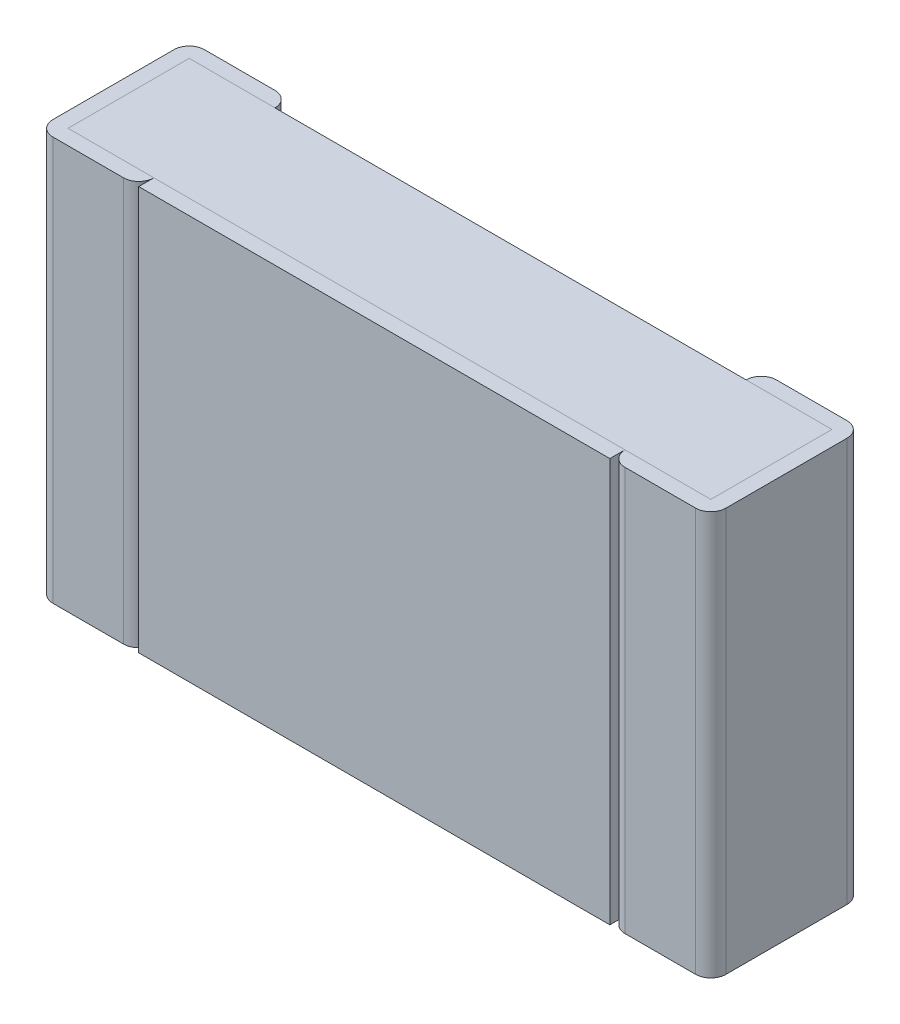
ISO-10303-21;
HEADER;
FILE_DESCRIPTION(('STEP AP214'),'2;1');
FILE_NAME('part.step','',(''),(''),'','','');
FILE_SCHEMA(('AUTOMOTIVE_DESIGN { 1 0 10303 214 1 1 1 1 }'));
ENDSEC;
DATA;
#1=APPLICATION_CONTEXT('core data for automotive mechanical design processes');
#2=APPLICATION_PROTOCOL_DEFINITION('international standard','automotive_design',2000,#1);
#3=PRODUCT_CONTEXT('',#1,'mechanical');
#4=PRODUCT('Part','Part','',(#3));
#5=PRODUCT_RELATED_PRODUCT_CATEGORY('part','',(#4));
#6=PRODUCT_DEFINITION_FORMATION('','',#4);
#7=PRODUCT_DEFINITION_CONTEXT('part definition',#1,'design');
#8=PRODUCT_DEFINITION('design','',#6,#7);
#9=PRODUCT_DEFINITION_SHAPE('','',#8);
#10=(LENGTH_UNIT() NAMED_UNIT(*) SI_UNIT(.MILLI.,.METRE.));
#11=(NAMED_UNIT(*) PLANE_ANGLE_UNIT() SI_UNIT($,.RADIAN.));
#12=(NAMED_UNIT(*) SI_UNIT($,.STERADIAN.) SOLID_ANGLE_UNIT());
#13=UNCERTAINTY_MEASURE_WITH_UNIT(LENGTH_MEASURE(1.E-05),#10,'distance_accuracy_value','');
#14=(GEOMETRIC_REPRESENTATION_CONTEXT(3) GLOBAL_UNCERTAINTY_ASSIGNED_CONTEXT((#13)) GLOBAL_UNIT_ASSIGNED_CONTEXT((#10,
#11,#12)) REPRESENTATION_CONTEXT('',''));
#15=CARTESIAN_POINT('',(0.,0.,0.));
#16=DIRECTION('',(0.,0.,1.));
#17=DIRECTION('',(1.,0.,0.));
#18=AXIS2_PLACEMENT_3D('',#15,#16,#17);
#19=CARTESIAN_POINT('',(-1.,-0.6,0.));
#20=DIRECTION('',(1.,0.,0.));
#21=DIRECTION('',(0.,1.,0.));
#22=AXIS2_PLACEMENT_3D('',#19,#20,#21);
#23=PLANE('',#22);
#24=DIRECTION('',(0.,1.,0.));
#25=VECTOR('',#24,1.);
#26=CARTESIAN_POINT('',(-1.,-0.6,0.405));
#27=LINE('',#26,#25);
#28=CARTESIAN_POINT('',(-1.,-0.6,0.405));
#29=VERTEX_POINT('',#28);
#30=CARTESIAN_POINT('',(-1.,0.6,0.405));
#31=VERTEX_POINT('',#30);
#32=EDGE_CURVE('E11',#29,#31,#27,.T.);
#33=ORIENTED_EDGE('',*,*,#32,.T.);
#34=DIRECTION('',(0.,0.,1.));
#35=VECTOR('',#34,1.);
#36=CARTESIAN_POINT('',(-1.,0.6,0.));
#37=LINE('',#36,#35);
#38=CARTESIAN_POINT('',(-1.,0.6,0.045));
#39=VERTEX_POINT('',#38);
#40=EDGE_CURVE('E41',#39,#31,#37,.T.);
#41=ORIENTED_EDGE('',*,*,#40,.F.);
#42=DIRECTION('',(0.,1.,0.));
#43=VECTOR('',#42,1.);
#44=CARTESIAN_POINT('',(-1.,-0.6,0.045));
#45=LINE('',#44,#43);
#46=CARTESIAN_POINT('',(-1.,-0.6,0.045));
#47=VERTEX_POINT('',#46);
#48=EDGE_CURVE('E279',#47,#39,#45,.T.);
#49=ORIENTED_EDGE('',*,*,#48,.F.);
#50=DIRECTION('',(0.,0.,1.));
#51=VECTOR('',#50,1.);
#52=CARTESIAN_POINT('',(-1.,-0.6,0.));
#53=LINE('',#52,#51);
#54=EDGE_CURVE('E27',#47,#29,#53,.T.);
#55=ORIENTED_EDGE('',*,*,#54,.T.);
#56=EDGE_LOOP('',(#33,#41,#49,#55));
#57=FACE_BOUND('',#56,.T.);
#58=ADVANCED_FACE('F16',(#57),#23,.F.);
#59=CARTESIAN_POINT('',(-1.,-0.6,0.));
#60=DIRECTION('',(0.,1.,0.));
#61=DIRECTION('',(1.,0.,0.));
#62=AXIS2_PLACEMENT_3D('',#59,#60,#61);
#63=PLANE('',#62);
#64=CARTESIAN_POINT('',(-0.745,-0.6,0.045));
#65=DIRECTION('',(0.,1.,0.));
#66=DIRECTION('',(0.,0.,1.));
#67=AXIS2_PLACEMENT_3D('',#64,#65,#66);
#68=CIRCLE('',#67,0.045);
#69=CARTESIAN_POINT('',(-0.7,-0.6,0.045));
#70=VERTEX_POINT('',#69);
#71=CARTESIAN_POINT('',(-0.745,-0.6,0.));
#72=VERTEX_POINT('',#71);
#73=EDGE_CURVE('E434',#70,#72,#68,.T.);
#74=ORIENTED_EDGE('',*,*,#73,.F.);
#75=DIRECTION('',(1.,0.,0.));
#76=VECTOR('',#75,1.);
#77=CARTESIAN_POINT('',(-0.955,-0.6,0.045));
#78=LINE('',#77,#76);
#79=CARTESIAN_POINT('',(-0.955,-0.6,0.045));
#80=VERTEX_POINT('',#79);
#81=EDGE_CURVE('E228',#80,#70,#78,.T.);
#82=ORIENTED_EDGE('',*,*,#81,.F.);
#83=DIRECTION('',(0.,0.,1.));
#84=VECTOR('',#83,1.);
#85=CARTESIAN_POINT('',(-0.955,-0.6,0.045));
#86=LINE('',#85,#84);
#87=CARTESIAN_POINT('',(-0.955,-0.6,0.405));
#88=VERTEX_POINT('',#87);
#89=EDGE_CURVE('E220',#80,#88,#86,.T.);
#90=ORIENTED_EDGE('',*,*,#89,.T.);
#91=DIRECTION('',(1.,0.,0.));
#92=VECTOR('',#91,1.);
#93=CARTESIAN_POINT('',(-0.955,-0.6,0.405));
#94=LINE('',#93,#92);
#95=CARTESIAN_POINT('',(-0.7,-0.6,0.405));
#96=VERTEX_POINT('',#95);
#97=EDGE_CURVE('E225',#88,#96,#94,.T.);
#98=ORIENTED_EDGE('',*,*,#97,.T.);
#99=CARTESIAN_POINT('',(-0.745,-0.6,0.405));
#100=DIRECTION('',(0.,-1.,0.));
#101=DIRECTION('',(0.,0.,1.));
#102=AXIS2_PLACEMENT_3D('',#99,#100,#101);
#103=CIRCLE('',#102,0.045);
#104=CARTESIAN_POINT('',(-0.745,-0.6,0.45));
#105=VERTEX_POINT('',#104);
#106=EDGE_CURVE('E238',#96,#105,#103,.T.);
#107=ORIENTED_EDGE('',*,*,#106,.T.);
#108=DIRECTION('',(1.,0.,0.));
#109=VECTOR('',#108,1.);
#110=CARTESIAN_POINT('',(-1.,-0.6,0.45));
#111=LINE('',#110,#109);
#112=CARTESIAN_POINT('',(-0.955,-0.6,0.45));
#113=VERTEX_POINT('',#112);
#114=EDGE_CURVE('E273',#113,#105,#111,.T.);
#115=ORIENTED_EDGE('',*,*,#114,.F.);
#116=CARTESIAN_POINT('',(-0.955,-0.6,0.405));
#117=DIRECTION('',(0.,1.,0.));
#118=DIRECTION('',(0.,0.,1.));
#119=AXIS2_PLACEMENT_3D('',#116,#117,#118);
#120=CIRCLE('',#119,0.045);
#121=EDGE_CURVE('E254',#29,#113,#120,.T.);
#122=ORIENTED_EDGE('',*,*,#121,.F.);
#123=ORIENTED_EDGE('',*,*,#54,.F.);
#124=CARTESIAN_POINT('',(-0.955,-0.6,0.045));
#125=DIRECTION('',(0.,-1.,0.));
#126=DIRECTION('',(0.,0.,1.));
#127=AXIS2_PLACEMENT_3D('',#124,#125,#126);
#128=CIRCLE('',#127,0.045);
#129=CARTESIAN_POINT('',(-0.955,-0.6,0.));
#130=VERTEX_POINT('',#129);
#131=EDGE_CURVE('E244',#47,#130,#128,.T.);
#132=ORIENTED_EDGE('',*,*,#131,.T.);
#133=DIRECTION('',(1.,0.,0.));
#134=VECTOR('',#133,1.);
#135=CARTESIAN_POINT('',(-1.,-0.6,0.));
#136=LINE('',#135,#134);
#137=EDGE_CURVE('E275',#130,#72,#136,.T.);
#138=ORIENTED_EDGE('',*,*,#137,.T.);
#139=EDGE_LOOP('',(#74,#82,#90,#98,#107,#115,#122,#123,#132,#138));
#140=FACE_BOUND('',#139,.T.);
#141=ADVANCED_FACE('F223',(#140),#63,.F.);
#142=CARTESIAN_POINT('',(-0.955,-0.6,0.045));
#143=DIRECTION('',(0.,1.,0.));
#144=DIRECTION('',(-1.,0.,0.));
#145=AXIS2_PLACEMENT_3D('',#142,#143,#144);
#146=CYLINDRICAL_SURFACE('',#145,0.045);
#147=ORIENTED_EDGE('',*,*,#48,.T.);
#148=CARTESIAN_POINT('',(-0.955,0.6,0.045));
#149=DIRECTION('',(0.,-1.,0.));
#150=DIRECTION('',(0.,0.,1.));
#151=AXIS2_PLACEMENT_3D('',#148,#149,#150);
#152=CIRCLE('',#151,0.045);
#153=CARTESIAN_POINT('',(-0.955,0.6,0.));
#154=VERTEX_POINT('',#153);
#155=EDGE_CURVE('E258',#39,#154,#152,.T.);
#156=ORIENTED_EDGE('',*,*,#155,.T.);
#157=DIRECTION('',(0.,1.,0.));
#158=VECTOR('',#157,1.);
#159=CARTESIAN_POINT('',(-0.955,-0.6,0.));
#160=LINE('',#159,#158);
#161=EDGE_CURVE('E387',#130,#154,#160,.T.);
#162=ORIENTED_EDGE('',*,*,#161,.F.);
#163=ORIENTED_EDGE('',*,*,#131,.F.);
#164=EDGE_LOOP('',(#147,#156,#162,#163));
#165=FACE_BOUND('',#164,.T.);
#166=ADVANCED_FACE('F514',(#165),#146,.T.);
#167=CARTESIAN_POINT('',(-0.955,-0.6,0.405));
#168=DIRECTION('',(0.,1.,0.));
#169=DIRECTION('',(-1.,0.,0.));
#170=AXIS2_PLACEMENT_3D('',#167,#168,#169);
#171=CYLINDRICAL_SURFACE('',#170,0.045);
#172=ORIENTED_EDGE('',*,*,#121,.T.);
#173=DIRECTION('',(0.,1.,0.));
#174=VECTOR('',#173,1.);
#175=CARTESIAN_POINT('',(-0.955,-0.6,0.45));
#176=LINE('',#175,#174);
#177=CARTESIAN_POINT('',(-0.955,0.6,0.45));
#178=VERTEX_POINT('',#177);
#179=EDGE_CURVE('E259',#113,#178,#176,.T.);
#180=ORIENTED_EDGE('',*,*,#179,.T.);
#181=CARTESIAN_POINT('',(-0.955,0.6,0.405));
#182=DIRECTION('',(0.,1.,0.));
#183=DIRECTION('',(0.,0.,1.));
#184=AXIS2_PLACEMENT_3D('',#181,#182,#183);
#185=CIRCLE('',#184,0.045);
#186=EDGE_CURVE('E310',#31,#178,#185,.T.);
#187=ORIENTED_EDGE('',*,*,#186,.F.);
#188=ORIENTED_EDGE('',*,*,#32,.F.);
#189=EDGE_LOOP('',(#172,#180,#187,#188));
#190=FACE_BOUND('',#189,.T.);
#191=ADVANCED_FACE('F774',(#190),#171,.T.);
#192=CARTESIAN_POINT('',(-1.,0.6,0.));
#193=DIRECTION('',(0.,1.,0.));
#194=DIRECTION('',(1.,0.,0.));
#195=AXIS2_PLACEMENT_3D('',#192,#193,#194);
#196=PLANE('',#195);
#197=DIRECTION('',(1.,0.,0.));
#198=VECTOR('',#197,1.);
#199=CARTESIAN_POINT('',(-1.,0.6,0.));
#200=LINE('',#199,#198);
#201=CARTESIAN_POINT('',(-0.745,0.6,0.));
#202=VERTEX_POINT('',#201);
#203=EDGE_CURVE('E401',#154,#202,#200,.T.);
#204=ORIENTED_EDGE('',*,*,#203,.F.);
#205=ORIENTED_EDGE('',*,*,#155,.F.);
#206=ORIENTED_EDGE('',*,*,#40,.T.);
#207=ORIENTED_EDGE('',*,*,#186,.T.);
#208=DIRECTION('',(1.,0.,0.));
#209=VECTOR('',#208,1.);
#210=CARTESIAN_POINT('',(-1.,0.6,0.45));
#211=LINE('',#210,#209);
#212=CARTESIAN_POINT('',(-0.745,0.6,0.45));
#213=VERTEX_POINT('',#212);
#214=EDGE_CURVE('E306',#178,#213,#211,.T.);
#215=ORIENTED_EDGE('',*,*,#214,.T.);
#216=CARTESIAN_POINT('',(-0.745,0.6,0.405));
#217=DIRECTION('',(0.,-1.,0.));
#218=DIRECTION('',(0.,0.,1.));
#219=AXIS2_PLACEMENT_3D('',#216,#217,#218);
#220=CIRCLE('',#219,0.045);
#221=CARTESIAN_POINT('',(-0.7,0.6,0.405));
#222=VERTEX_POINT('',#221);
#223=EDGE_CURVE('E299',#222,#213,#220,.T.);
#224=ORIENTED_EDGE('',*,*,#223,.F.);
#225=DIRECTION('',(1.,0.,0.));
#226=VECTOR('',#225,1.);
#227=CARTESIAN_POINT('',(-0.955,0.6,0.405));
#228=LINE('',#227,#226);
#229=CARTESIAN_POINT('',(-0.955,0.6,0.405));
#230=VERTEX_POINT('',#229);
#231=EDGE_CURVE('E280',#230,#222,#228,.T.);
#232=ORIENTED_EDGE('',*,*,#231,.F.);
#233=DIRECTION('',(0.,0.,1.));
#234=VECTOR('',#233,1.);
#235=CARTESIAN_POINT('',(-0.955,0.6,0.045));
#236=LINE('',#235,#234);
#237=CARTESIAN_POINT('',(-0.955,0.6,0.045));
#238=VERTEX_POINT('',#237);
#239=EDGE_CURVE('E284',#238,#230,#236,.T.);
#240=ORIENTED_EDGE('',*,*,#239,.F.);
#241=DIRECTION('',(1.,0.,0.));
#242=VECTOR('',#241,1.);
#243=CARTESIAN_POINT('',(-0.955,0.6,0.045));
#244=LINE('',#243,#242);
#245=CARTESIAN_POINT('',(-0.7,0.6,0.045));
#246=VERTEX_POINT('',#245);
#247=EDGE_CURVE('E311',#238,#246,#244,.T.);
#248=ORIENTED_EDGE('',*,*,#247,.T.);
#249=CARTESIAN_POINT('',(-0.745,0.6,0.045));
#250=DIRECTION('',(0.,1.,0.));
#251=DIRECTION('',(0.,0.,1.));
#252=AXIS2_PLACEMENT_3D('',#249,#250,#251);
#253=CIRCLE('',#252,0.045);
#254=EDGE_CURVE('E383',#246,#202,#253,.T.);
#255=ORIENTED_EDGE('',*,*,#254,.T.);
#256=EDGE_LOOP('',(#204,#205,#206,#207,#215,#224,#232,#240,#248,#255));
#257=FACE_BOUND('',#256,.T.);
#258=ADVANCED_FACE('F418',(#257),#196,.T.);
#259=CARTESIAN_POINT('',(-1.,-0.6,0.));
#260=DIRECTION('',(0.,0.,1.));
#261=DIRECTION('',(1.,0.,0.));
#262=AXIS2_PLACEMENT_3D('',#259,#260,#261);
#263=PLANE('',#262);
#264=DIRECTION('',(0.,1.,0.));
#265=VECTOR('',#264,1.);
#266=CARTESIAN_POINT('',(-0.745,-0.6,0.));
#267=LINE('',#266,#265);
#268=EDGE_CURVE('E467',#72,#202,#267,.T.);
#269=ORIENTED_EDGE('',*,*,#268,.F.);
#270=ORIENTED_EDGE('',*,*,#137,.F.);
#271=ORIENTED_EDGE('',*,*,#161,.T.);
#272=ORIENTED_EDGE('',*,*,#203,.T.);
#273=EDGE_LOOP('',(#269,#270,#271,#272));
#274=FACE_BOUND('',#273,.T.);
#275=ADVANCED_FACE('F784',(#274),#263,.F.);
#276=CARTESIAN_POINT('',(-0.745,-0.6,0.045));
#277=DIRECTION('',(0.,1.,0.));
#278=DIRECTION('',(1.,0.,0.));
#279=AXIS2_PLACEMENT_3D('',#276,#277,#278);
#280=CYLINDRICAL_SURFACE('',#279,0.045);
#281=ORIENTED_EDGE('',*,*,#73,.T.);
#282=ORIENTED_EDGE('',*,*,#268,.T.);
#283=ORIENTED_EDGE('',*,*,#254,.F.);
#284=DIRECTION('',(0.,1.,0.));
#285=VECTOR('',#284,1.);
#286=CARTESIAN_POINT('',(-0.7,-0.6,0.045));
#287=LINE('',#286,#285);
#288=EDGE_CURVE('E327',#70,#246,#287,.T.);
#289=ORIENTED_EDGE('',*,*,#288,.F.);
#290=EDGE_LOOP('',(#281,#282,#283,#289));
#291=FACE_BOUND('',#290,.T.);
#292=ADVANCED_FACE('F18',(#291),#280,.T.);
#293=CARTESIAN_POINT('',(-0.955,-0.6,0.045));
#294=DIRECTION('',(0.,1.,0.));
#295=DIRECTION('',(1.,0.,0.));
#296=AXIS2_PLACEMENT_3D('',#293,#294,#295);
#297=PLANE('',#296);
#298=DIRECTION('',(1.,0.,0.));
#299=VECTOR('',#298,1.);
#300=CARTESIAN_POINT('',(-0.955,-0.6,0.045));
#301=LINE('',#300,#299);
#302=CARTESIAN_POINT('',(0.7,-0.6,0.045));
#303=VERTEX_POINT('',#302);
#304=EDGE_CURVE('E470',#70,#303,#301,.T.);
#305=ORIENTED_EDGE('',*,*,#304,.T.);
#306=DIRECTION('',(1.,0.,0.));
#307=VECTOR('',#306,1.);
#308=CARTESIAN_POINT('',(-0.955,-0.6,0.045));
#309=LINE('',#308,#307);
#310=CARTESIAN_POINT('',(0.955,-0.6,0.045));
#311=VERTEX_POINT('',#310);
#312=EDGE_CURVE('E547',#303,#311,#309,.T.);
#313=ORIENTED_EDGE('',*,*,#312,.T.);
#314=DIRECTION('',(0.,0.,1.));
#315=VECTOR('',#314,1.);
#316=CARTESIAN_POINT('',(0.955,-0.6,0.045));
#317=LINE('',#316,#315);
#318=CARTESIAN_POINT('',(0.955,-0.6,0.405));
#319=VERTEX_POINT('',#318);
#320=EDGE_CURVE('E272',#311,#319,#317,.T.);
#321=ORIENTED_EDGE('',*,*,#320,.T.);
#322=DIRECTION('',(1.,0.,0.));
#323=VECTOR('',#322,1.);
#324=CARTESIAN_POINT('',(-0.955,-0.6,0.405));
#325=LINE('',#324,#323);
#326=CARTESIAN_POINT('',(0.7,-0.6,0.405));
#327=VERTEX_POINT('',#326);
#328=EDGE_CURVE('E248',#327,#319,#325,.T.);
#329=ORIENTED_EDGE('',*,*,#328,.F.);
#330=DIRECTION('',(1.,0.,0.));
#331=VECTOR('',#330,1.);
#332=CARTESIAN_POINT('',(-0.7,-0.6,0.405));
#333=LINE('',#332,#331);
#334=EDGE_CURVE('E235',#96,#327,#333,.T.);
#335=ORIENTED_EDGE('',*,*,#334,.F.);
#336=ORIENTED_EDGE('',*,*,#97,.F.);
#337=ORIENTED_EDGE('',*,*,#89,.F.);
#338=ORIENTED_EDGE('',*,*,#81,.T.);
#339=EDGE_LOOP('',(#305,#313,#321,#329,#335,#336,#337,#338));
#340=FACE_BOUND('',#339,.T.);
#341=ADVANCED_FACE('F233',(#340),#297,.F.);
#342=CARTESIAN_POINT('',(-1.,-0.6,0.45));
#343=DIRECTION('',(0.,0.,1.));
#344=DIRECTION('',(1.,0.,0.));
#345=AXIS2_PLACEMENT_3D('',#342,#343,#344);
#346=PLANE('',#345);
#347=ORIENTED_EDGE('',*,*,#214,.F.);
#348=ORIENTED_EDGE('',*,*,#179,.F.);
#349=ORIENTED_EDGE('',*,*,#114,.T.);
#350=DIRECTION('',(0.,1.,0.));
#351=VECTOR('',#350,1.);
#352=CARTESIAN_POINT('',(-0.745,-0.6,0.45));
#353=LINE('',#352,#351);
#354=EDGE_CURVE('E298',#105,#213,#353,.T.);
#355=ORIENTED_EDGE('',*,*,#354,.T.);
#356=EDGE_LOOP('',(#347,#348,#349,#355));
#357=FACE_BOUND('',#356,.T.);
#358=ADVANCED_FACE('F567',(#357),#346,.T.);
#359=CARTESIAN_POINT('',(-0.745,-0.6,0.405));
#360=DIRECTION('',(0.,1.,0.));
#361=DIRECTION('',(1.,0.,0.));
#362=AXIS2_PLACEMENT_3D('',#359,#360,#361);
#363=CYLINDRICAL_SURFACE('',#362,0.045);
#364=DIRECTION('',(0.,1.,0.));
#365=VECTOR('',#364,1.);
#366=CARTESIAN_POINT('',(-0.7,-0.6,0.405));
#367=LINE('',#366,#365);
#368=EDGE_CURVE('E294',#96,#222,#367,.T.);
#369=ORIENTED_EDGE('',*,*,#368,.T.);
#370=ORIENTED_EDGE('',*,*,#223,.T.);
#371=ORIENTED_EDGE('',*,*,#354,.F.);
#372=ORIENTED_EDGE('',*,*,#106,.F.);
#373=EDGE_LOOP('',(#369,#370,#371,#372));
#374=FACE_BOUND('',#373,.T.);
#375=ADVANCED_FACE('F572',(#374),#363,.T.);
#376=CARTESIAN_POINT('',(-0.955,0.6,0.045));
#377=DIRECTION('',(0.,1.,0.));
#378=DIRECTION('',(1.,0.,0.));
#379=AXIS2_PLACEMENT_3D('',#376,#377,#378);
#380=PLANE('',#379);
#381=ORIENTED_EDGE('',*,*,#247,.F.);
#382=ORIENTED_EDGE('',*,*,#239,.T.);
#383=ORIENTED_EDGE('',*,*,#231,.T.);
#384=DIRECTION('',(1.,0.,0.));
#385=VECTOR('',#384,1.);
#386=CARTESIAN_POINT('',(-0.7,0.6,0.405));
#387=LINE('',#386,#385);
#388=CARTESIAN_POINT('',(0.7,0.6,0.405));
#389=VERTEX_POINT('',#388);
#390=EDGE_CURVE('E252',#222,#389,#387,.T.);
#391=ORIENTED_EDGE('',*,*,#390,.T.);
#392=DIRECTION('',(1.,0.,0.));
#393=VECTOR('',#392,1.);
#394=CARTESIAN_POINT('',(-0.955,0.6,0.405));
#395=LINE('',#394,#393);
#396=CARTESIAN_POINT('',(0.955,0.6,0.405));
#397=VERTEX_POINT('',#396);
#398=EDGE_CURVE('E250',#389,#397,#395,.T.);
#399=ORIENTED_EDGE('',*,*,#398,.T.);
#400=DIRECTION('',(0.,0.,1.));
#401=VECTOR('',#400,1.);
#402=CARTESIAN_POINT('',(0.955,0.6,0.045));
#403=LINE('',#402,#401);
#404=CARTESIAN_POINT('',(0.955,0.6,0.045));
#405=VERTEX_POINT('',#404);
#406=EDGE_CURVE('E289',#405,#397,#403,.T.);
#407=ORIENTED_EDGE('',*,*,#406,.F.);
#408=DIRECTION('',(1.,0.,0.));
#409=VECTOR('',#408,1.);
#410=CARTESIAN_POINT('',(-0.955,0.6,0.045));
#411=LINE('',#410,#409);
#412=CARTESIAN_POINT('',(0.7,0.6,0.045));
#413=VERTEX_POINT('',#412);
#414=EDGE_CURVE('E265',#413,#405,#411,.T.);
#415=ORIENTED_EDGE('',*,*,#414,.F.);
#416=DIRECTION('',(1.,0.,0.));
#417=VECTOR('',#416,1.);
#418=CARTESIAN_POINT('',(-0.955,0.6,0.045));
#419=LINE('',#418,#417);
#420=EDGE_CURVE('E253',#246,#413,#419,.T.);
#421=ORIENTED_EDGE('',*,*,#420,.F.);
#422=EDGE_LOOP('',(#381,#382,#383,#391,#399,#407,#415,#421));
#423=FACE_BOUND('',#422,.T.);
#424=ADVANCED_FACE('F422',(#423),#380,.T.);
#425=CARTESIAN_POINT('',(-0.955,-0.6,0.045));
#426=DIRECTION('',(0.,0.,1.));
#427=DIRECTION('',(1.,0.,0.));
#428=AXIS2_PLACEMENT_3D('',#425,#426,#427);
#429=PLANE('',#428);
#430=ORIENTED_EDGE('',*,*,#420,.T.);
#431=DIRECTION('',(0.,1.,0.));
#432=VECTOR('',#431,1.);
#433=CARTESIAN_POINT('',(0.7,-0.6,0.045));
#434=LINE('',#433,#432);
#435=EDGE_CURVE('E270',#303,#413,#434,.T.);
#436=ORIENTED_EDGE('',*,*,#435,.F.);
#437=ORIENTED_EDGE('',*,*,#304,.F.);
#438=ORIENTED_EDGE('',*,*,#288,.T.);
#439=EDGE_LOOP('',(#430,#436,#437,#438));
#440=FACE_BOUND('',#439,.T.);
#441=ADVANCED_FACE('F551',(#440),#429,.F.);
#442=CARTESIAN_POINT('',(0.7,-0.6,0.));
#443=DIRECTION('',(0.,1.,0.));
#444=DIRECTION('',(1.,0.,0.));
#445=AXIS2_PLACEMENT_3D('',#442,#443,#444);
#446=PLANE('',#445);
#447=CARTESIAN_POINT('',(0.955,-0.6,0.045));
#448=DIRECTION('',(0.,1.,0.));
#449=DIRECTION('',(0.,0.,1.));
#450=AXIS2_PLACEMENT_3D('',#447,#448,#449);
#451=CIRCLE('',#450,0.045);
#452=CARTESIAN_POINT('',(1.,-0.6,0.045));
#453=VERTEX_POINT('',#452);
#454=CARTESIAN_POINT('',(0.955,-0.6,0.));
#455=VERTEX_POINT('',#454);
#456=EDGE_CURVE('E20',#453,#455,#451,.T.);
#457=ORIENTED_EDGE('',*,*,#456,.F.);
#458=DIRECTION('',(0.,0.,1.));
#459=VECTOR('',#458,1.);
#460=CARTESIAN_POINT('',(1.,-0.6,0.));
#461=LINE('',#460,#459);
#462=CARTESIAN_POINT('',(1.,-0.6,0.405));
#463=VERTEX_POINT('',#462);
#464=EDGE_CURVE('E323',#453,#463,#461,.T.);
#465=ORIENTED_EDGE('',*,*,#464,.T.);
#466=CARTESIAN_POINT('',(0.955,-0.6,0.405));
#467=DIRECTION('',(0.,-1.,0.));
#468=DIRECTION('',(0.,0.,1.));
#469=AXIS2_PLACEMENT_3D('',#466,#467,#468);
#470=CIRCLE('',#469,0.045);
#471=CARTESIAN_POINT('',(0.955,-0.6,0.45));
#472=VERTEX_POINT('',#471);
#473=EDGE_CURVE('E328',#463,#472,#470,.T.);
#474=ORIENTED_EDGE('',*,*,#473,.T.);
#475=DIRECTION('',(1.,0.,0.));
#476=VECTOR('',#475,1.);
#477=CARTESIAN_POINT('',(0.7,-0.6,0.45));
#478=LINE('',#477,#476);
#479=CARTESIAN_POINT('',(0.745,-0.6,0.45));
#480=VERTEX_POINT('',#479);
#481=EDGE_CURVE('E402',#480,#472,#478,.T.);
#482=ORIENTED_EDGE('',*,*,#481,.F.);
#483=CARTESIAN_POINT('',(0.745,-0.6,0.405));
#484=DIRECTION('',(0.,1.,0.));
#485=DIRECTION('',(0.,0.,1.));
#486=AXIS2_PLACEMENT_3D('',#483,#484,#485);
#487=CIRCLE('',#486,0.045);
#488=EDGE_CURVE('E204',#327,#480,#487,.T.);
#489=ORIENTED_EDGE('',*,*,#488,.F.);
#490=ORIENTED_EDGE('',*,*,#328,.T.);
#491=ORIENTED_EDGE('',*,*,#320,.F.);
#492=ORIENTED_EDGE('',*,*,#312,.F.);
#493=CARTESIAN_POINT('',(0.745,-0.6,0.045));
#494=DIRECTION('',(0.,-1.,0.));
#495=DIRECTION('',(0.,0.,1.));
#496=AXIS2_PLACEMENT_3D('',#493,#494,#495);
#497=CIRCLE('',#496,0.045);
#498=CARTESIAN_POINT('',(0.745,-0.6,0.));
#499=VERTEX_POINT('',#498);
#500=EDGE_CURVE('E388',#303,#499,#497,.T.);
#501=ORIENTED_EDGE('',*,*,#500,.T.);
#502=DIRECTION('',(1.,0.,0.));
#503=VECTOR('',#502,1.);
#504=CARTESIAN_POINT('',(0.7,-0.6,0.));
#505=LINE('',#504,#503);
#506=EDGE_CURVE('E392',#499,#455,#505,.T.);
#507=ORIENTED_EDGE('',*,*,#506,.T.);
#508=EDGE_LOOP('',(#457,#465,#474,#482,#489,#490,#491,#492,#501,#507));
#509=FACE_BOUND('',#508,.T.);
#510=ADVANCED_FACE('F518',(#509),#446,.F.);
#511=CARTESIAN_POINT('',(-0.7,-0.6,0.405));
#512=DIRECTION('',(0.,1.,0.));
#513=DIRECTION('',(1.,0.,0.));
#514=AXIS2_PLACEMENT_3D('',#511,#512,#513);
#515=PLANE('',#514);
#516=DIRECTION('',(0.,0.,1.));
#517=VECTOR('',#516,1.);
#518=CARTESIAN_POINT('',(0.7,-0.6,0.405));
#519=LINE('',#518,#517);
#520=CARTESIAN_POINT('',(0.7,-0.6,0.45));
#521=VERTEX_POINT('',#520);
#522=EDGE_CURVE('E314',#327,#521,#519,.T.);
#523=ORIENTED_EDGE('',*,*,#522,.T.);
#524=DIRECTION('',(1.,0.,0.));
#525=VECTOR('',#524,1.);
#526=CARTESIAN_POINT('',(-0.7,-0.6,0.45));
#527=LINE('',#526,#525);
#528=CARTESIAN_POINT('',(-0.7,-0.6,0.45));
#529=VERTEX_POINT('',#528);
#530=EDGE_CURVE('E285',#529,#521,#527,.T.);
#531=ORIENTED_EDGE('',*,*,#530,.F.);
#532=DIRECTION('',(0.,0.,1.));
#533=VECTOR('',#532,1.);
#534=CARTESIAN_POINT('',(-0.7,-0.6,0.405));
#535=LINE('',#534,#533);
#536=EDGE_CURVE('E260',#96,#529,#535,.T.);
#537=ORIENTED_EDGE('',*,*,#536,.F.);
#538=ORIENTED_EDGE('',*,*,#334,.T.);
#539=EDGE_LOOP('',(#523,#531,#537,#538));
#540=FACE_BOUND('',#539,.T.);
#541=ADVANCED_FACE('F504',(#540),#515,.F.);
#542=CARTESIAN_POINT('',(-0.7,-0.6,0.405));
#543=DIRECTION('',(1.,0.,0.));
#544=DIRECTION('',(0.,1.,0.));
#545=AXIS2_PLACEMENT_3D('',#542,#543,#544);
#546=PLANE('',#545);
#547=DIRECTION('',(0.,1.,0.));
#548=VECTOR('',#547,1.);
#549=CARTESIAN_POINT('',(-0.7,-0.6,0.45));
#550=LINE('',#549,#548);
#551=CARTESIAN_POINT('',(-0.7,0.6,0.45));
#552=VERTEX_POINT('',#551);
#553=EDGE_CURVE('E264',#529,#552,#550,.T.);
#554=ORIENTED_EDGE('',*,*,#553,.T.);
#555=DIRECTION('',(0.,0.,1.));
#556=VECTOR('',#555,1.);
#557=CARTESIAN_POINT('',(-0.7,0.6,0.405));
#558=LINE('',#557,#556);
#559=EDGE_CURVE('E269',#222,#552,#558,.T.);
#560=ORIENTED_EDGE('',*,*,#559,.F.);
#561=ORIENTED_EDGE('',*,*,#368,.F.);
#562=ORIENTED_EDGE('',*,*,#536,.T.);
#563=EDGE_LOOP('',(#554,#560,#561,#562));
#564=FACE_BOUND('',#563,.T.);
#565=ADVANCED_FACE('F492',(#564),#546,.F.);
#566=CARTESIAN_POINT('',(0.7,0.6,0.));
#567=DIRECTION('',(0.,1.,0.));
#568=DIRECTION('',(1.,0.,0.));
#569=AXIS2_PLACEMENT_3D('',#566,#567,#568);
#570=PLANE('',#569);
#571=DIRECTION('',(1.,0.,0.));
#572=VECTOR('',#571,1.);
#573=CARTESIAN_POINT('',(0.7,0.6,0.));
#574=LINE('',#573,#572);
#575=CARTESIAN_POINT('',(0.745,0.6,0.));
#576=VERTEX_POINT('',#575);
#577=CARTESIAN_POINT('',(0.955,0.6,0.));
#578=VERTEX_POINT('',#577);
#579=EDGE_CURVE('E349',#576,#578,#574,.T.);
#580=ORIENTED_EDGE('',*,*,#579,.F.);
#581=CARTESIAN_POINT('',(0.745,0.6,0.045));
#582=DIRECTION('',(0.,-1.,0.));
#583=DIRECTION('',(0.,0.,1.));
#584=AXIS2_PLACEMENT_3D('',#581,#582,#583);
#585=CIRCLE('',#584,0.045);
#586=EDGE_CURVE('E322',#413,#576,#585,.T.);
#587=ORIENTED_EDGE('',*,*,#586,.F.);
#588=ORIENTED_EDGE('',*,*,#414,.T.);
#589=ORIENTED_EDGE('',*,*,#406,.T.);
#590=ORIENTED_EDGE('',*,*,#398,.F.);
#591=CARTESIAN_POINT('',(0.745,0.6,0.405));
#592=DIRECTION('',(0.,1.,0.));
#593=DIRECTION('',(0.,0.,1.));
#594=AXIS2_PLACEMENT_3D('',#591,#592,#593);
#595=CIRCLE('',#594,0.045);
#596=CARTESIAN_POINT('',(0.745,0.6,0.45));
#597=VERTEX_POINT('',#596);
#598=EDGE_CURVE('E293',#389,#597,#595,.T.);
#599=ORIENTED_EDGE('',*,*,#598,.T.);
#600=DIRECTION('',(1.,0.,0.));
#601=VECTOR('',#600,1.);
#602=CARTESIAN_POINT('',(0.7,0.6,0.45));
#603=LINE('',#602,#601);
#604=CARTESIAN_POINT('',(0.955,0.6,0.45));
#605=VERTEX_POINT('',#604);
#606=EDGE_CURVE('E375',#597,#605,#603,.T.);
#607=ORIENTED_EDGE('',*,*,#606,.T.);
#608=CARTESIAN_POINT('',(0.955,0.6,0.405));
#609=DIRECTION('',(0.,-1.,0.));
#610=DIRECTION('',(0.,0.,1.));
#611=AXIS2_PLACEMENT_3D('',#608,#609,#610);
#612=CIRCLE('',#611,0.045);
#613=CARTESIAN_POINT('',(1.,0.6,0.405));
#614=VERTEX_POINT('',#613);
#615=EDGE_CURVE('E353',#614,#605,#612,.T.);
#616=ORIENTED_EDGE('',*,*,#615,.F.);
#617=DIRECTION('',(0.,0.,1.));
#618=VECTOR('',#617,1.);
#619=CARTESIAN_POINT('',(1.,0.6,0.));
#620=LINE('',#619,#618);
#621=CARTESIAN_POINT('',(1.,0.6,0.045));
#622=VERTEX_POINT('',#621);
#623=EDGE_CURVE('E300',#622,#614,#620,.T.);
#624=ORIENTED_EDGE('',*,*,#623,.F.);
#625=CARTESIAN_POINT('',(0.955,0.6,0.045));
#626=DIRECTION('',(0.,1.,0.));
#627=DIRECTION('',(0.,0.,1.));
#628=AXIS2_PLACEMENT_3D('',#625,#626,#627);
#629=CIRCLE('',#628,0.045);
#630=EDGE_CURVE('E337',#622,#578,#629,.T.);
#631=ORIENTED_EDGE('',*,*,#630,.T.);
#632=EDGE_LOOP('',(#580,#587,#588,#589,#590,#599,#607,#616,#624,#631));
#633=FACE_BOUND('',#632,.T.);
#634=ADVANCED_FACE('F488',(#633),#570,.T.);
#635=CARTESIAN_POINT('',(-0.7,0.6,0.405));
#636=DIRECTION('',(0.,1.,0.));
#637=DIRECTION('',(1.,0.,0.));
#638=AXIS2_PLACEMENT_3D('',#635,#636,#637);
#639=PLANE('',#638);
#640=ORIENTED_EDGE('',*,*,#390,.F.);
#641=ORIENTED_EDGE('',*,*,#559,.T.);
#642=DIRECTION('',(1.,0.,0.));
#643=VECTOR('',#642,1.);
#644=CARTESIAN_POINT('',(-0.7,0.6,0.45));
#645=LINE('',#644,#643);
#646=CARTESIAN_POINT('',(0.7,0.6,0.45));
#647=VERTEX_POINT('',#646);
#648=EDGE_CURVE('E266',#552,#647,#645,.T.);
#649=ORIENTED_EDGE('',*,*,#648,.T.);
#650=DIRECTION('',(0.,0.,1.));
#651=VECTOR('',#650,1.);
#652=CARTESIAN_POINT('',(0.7,0.6,0.405));
#653=LINE('',#652,#651);
#654=EDGE_CURVE('E193',#389,#647,#653,.T.);
#655=ORIENTED_EDGE('',*,*,#654,.F.);
#656=EDGE_LOOP('',(#640,#641,#649,#655));
#657=FACE_BOUND('',#656,.T.);
#658=ADVANCED_FACE('F491',(#657),#639,.T.);
#659=CARTESIAN_POINT('',(0.745,-0.6,0.045));
#660=DIRECTION('',(0.,1.,0.));
#661=DIRECTION('',(-1.,0.,0.));
#662=AXIS2_PLACEMENT_3D('',#659,#660,#661);
#663=CYLINDRICAL_SURFACE('',#662,0.045);
#664=ORIENTED_EDGE('',*,*,#435,.T.);
#665=ORIENTED_EDGE('',*,*,#586,.T.);
#666=DIRECTION('',(0.,1.,0.));
#667=VECTOR('',#666,1.);
#668=CARTESIAN_POINT('',(0.745,-0.6,0.));
#669=LINE('',#668,#667);
#670=EDGE_CURVE('E345',#499,#576,#669,.T.);
#671=ORIENTED_EDGE('',*,*,#670,.F.);
#672=ORIENTED_EDGE('',*,*,#500,.F.);
#673=EDGE_LOOP('',(#664,#665,#671,#672));
#674=FACE_BOUND('',#673,.T.);
#675=ADVANCED_FACE('F501',(#674),#663,.T.);
#676=CARTESIAN_POINT('',(0.7,-0.6,0.));
#677=DIRECTION('',(0.,0.,1.));
#678=DIRECTION('',(1.,0.,0.));
#679=AXIS2_PLACEMENT_3D('',#676,#677,#678);
#680=PLANE('',#679);
#681=DIRECTION('',(0.,1.,0.));
#682=VECTOR('',#681,1.);
#683=CARTESIAN_POINT('',(0.955,-0.6,0.));
#684=LINE('',#683,#682);
#685=EDGE_CURVE('E381',#455,#578,#684,.T.);
#686=ORIENTED_EDGE('',*,*,#685,.F.);
#687=ORIENTED_EDGE('',*,*,#506,.F.);
#688=ORIENTED_EDGE('',*,*,#670,.T.);
#689=ORIENTED_EDGE('',*,*,#579,.T.);
#690=EDGE_LOOP('',(#686,#687,#688,#689));
#691=FACE_BOUND('',#690,.T.);
#692=ADVANCED_FACE('F522',(#691),#680,.F.);
#693=CARTESIAN_POINT('',(0.955,-0.6,0.045));
#694=DIRECTION('',(0.,1.,0.));
#695=DIRECTION('',(1.,0.,0.));
#696=AXIS2_PLACEMENT_3D('',#693,#694,#695);
#697=CYLINDRICAL_SURFACE('',#696,0.045);
#698=ORIENTED_EDGE('',*,*,#456,.T.);
#699=ORIENTED_EDGE('',*,*,#685,.T.);
#700=ORIENTED_EDGE('',*,*,#630,.F.);
#701=DIRECTION('',(0.,1.,0.));
#702=VECTOR('',#701,1.);
#703=CARTESIAN_POINT('',(1.,-0.6,0.045));
#704=LINE('',#703,#702);
#705=EDGE_CURVE('E304',#453,#622,#704,.T.);
#706=ORIENTED_EDGE('',*,*,#705,.F.);
#707=EDGE_LOOP('',(#698,#699,#700,#706));
#708=FACE_BOUND('',#707,.T.);
#709=ADVANCED_FACE('F528',(#708),#697,.T.);
#710=CARTESIAN_POINT('',(1.,-0.6,0.));
#711=DIRECTION('',(1.,0.,0.));
#712=DIRECTION('',(0.,1.,0.));
#713=AXIS2_PLACEMENT_3D('',#710,#711,#712);
#714=PLANE('',#713);
#715=ORIENTED_EDGE('',*,*,#464,.F.);
#716=ORIENTED_EDGE('',*,*,#705,.T.);
#717=ORIENTED_EDGE('',*,*,#623,.T.);
#718=DIRECTION('',(0.,1.,0.));
#719=VECTOR('',#718,1.);
#720=CARTESIAN_POINT('',(1.,-0.6,0.405));
#721=LINE('',#720,#719);
#722=EDGE_CURVE('E305',#463,#614,#721,.T.);
#723=ORIENTED_EDGE('',*,*,#722,.F.);
#724=EDGE_LOOP('',(#715,#716,#717,#723));
#725=FACE_BOUND('',#724,.T.);
#726=ADVANCED_FACE('F524',(#725),#714,.T.);
#727=CARTESIAN_POINT('',(0.955,-0.6,0.405));
#728=DIRECTION('',(0.,1.,0.));
#729=DIRECTION('',(1.,0.,0.));
#730=AXIS2_PLACEMENT_3D('',#727,#728,#729);
#731=CYLINDRICAL_SURFACE('',#730,0.045);
#732=ORIENTED_EDGE('',*,*,#722,.T.);
#733=ORIENTED_EDGE('',*,*,#615,.T.);
#734=DIRECTION('',(0.,1.,0.));
#735=VECTOR('',#734,1.);
#736=CARTESIAN_POINT('',(0.955,-0.6,0.45));
#737=LINE('',#736,#735);
#738=EDGE_CURVE('E378',#472,#605,#737,.T.);
#739=ORIENTED_EDGE('',*,*,#738,.F.);
#740=ORIENTED_EDGE('',*,*,#473,.F.);
#741=EDGE_LOOP('',(#732,#733,#739,#740));
#742=FACE_BOUND('',#741,.T.);
#743=ADVANCED_FACE('F527',(#742),#731,.T.);
#744=CARTESIAN_POINT('',(0.7,-0.6,0.45));
#745=DIRECTION('',(0.,0.,1.));
#746=DIRECTION('',(1.,0.,0.));
#747=AXIS2_PLACEMENT_3D('',#744,#745,#746);
#748=PLANE('',#747);
#749=ORIENTED_EDGE('',*,*,#606,.F.);
#750=DIRECTION('',(0.,1.,0.));
#751=VECTOR('',#750,1.);
#752=CARTESIAN_POINT('',(0.745,-0.6,0.45));
#753=LINE('',#752,#751);
#754=EDGE_CURVE('E338',#480,#597,#753,.T.);
#755=ORIENTED_EDGE('',*,*,#754,.F.);
#756=ORIENTED_EDGE('',*,*,#481,.T.);
#757=ORIENTED_EDGE('',*,*,#738,.T.);
#758=EDGE_LOOP('',(#749,#755,#756,#757));
#759=FACE_BOUND('',#758,.T.);
#760=ADVANCED_FACE('F532',(#759),#748,.T.);
#761=CARTESIAN_POINT('',(0.745,-0.6,0.405));
#762=DIRECTION('',(0.,1.,0.));
#763=DIRECTION('',(-1.,0.,0.));
#764=AXIS2_PLACEMENT_3D('',#761,#762,#763);
#765=CYLINDRICAL_SURFACE('',#764,0.045);
#766=ORIENTED_EDGE('',*,*,#488,.T.);
#767=ORIENTED_EDGE('',*,*,#754,.T.);
#768=ORIENTED_EDGE('',*,*,#598,.F.);
#769=DIRECTION('',(0.,1.,0.));
#770=VECTOR('',#769,1.);
#771=CARTESIAN_POINT('',(0.7,-0.6,0.405));
#772=LINE('',#771,#770);
#773=EDGE_CURVE('E342',#327,#389,#772,.T.);
#774=ORIENTED_EDGE('',*,*,#773,.F.);
#775=EDGE_LOOP('',(#766,#767,#768,#774));
#776=FACE_BOUND('',#775,.T.);
#777=ADVANCED_FACE('F483',(#776),#765,.T.);
#778=CARTESIAN_POINT('',(0.7,-0.6,0.405));
#779=DIRECTION('',(1.,0.,0.));
#780=DIRECTION('',(0.,1.,0.));
#781=AXIS2_PLACEMENT_3D('',#778,#779,#780);
#782=PLANE('',#781);
#783=ORIENTED_EDGE('',*,*,#522,.F.);
#784=ORIENTED_EDGE('',*,*,#773,.T.);
#785=ORIENTED_EDGE('',*,*,#654,.T.);
#786=DIRECTION('',(0.,1.,0.));
#787=VECTOR('',#786,1.);
#788=CARTESIAN_POINT('',(0.7,-0.6,0.45));
#789=LINE('',#788,#787);
#790=EDGE_CURVE('E288',#521,#647,#789,.T.);
#791=ORIENTED_EDGE('',*,*,#790,.F.);
#792=EDGE_LOOP('',(#783,#784,#785,#791));
#793=FACE_BOUND('',#792,.T.);
#794=ADVANCED_FACE('F480',(#793),#782,.T.);
#795=CARTESIAN_POINT('',(-0.7,-0.6,0.45));
#796=DIRECTION('',(0.,0.,1.));
#797=DIRECTION('',(1.,0.,0.));
#798=AXIS2_PLACEMENT_3D('',#795,#796,#797);
#799=PLANE('',#798);
#800=ORIENTED_EDGE('',*,*,#553,.F.);
#801=ORIENTED_EDGE('',*,*,#530,.T.);
#802=ORIENTED_EDGE('',*,*,#790,.T.);
#803=ORIENTED_EDGE('',*,*,#648,.F.);
#804=EDGE_LOOP('',(#800,#801,#802,#803));
#805=FACE_BOUND('',#804,.T.);
#806=ADVANCED_FACE('F533',(#805),#799,.T.);
#807=CLOSED_SHELL('',(#58,#141,#166,#191,#258,#275,#292,#341,#358,#375,#424,#441,#510,#541,#565,
#634,#658,#675,#692,#709,#726,#743,#760,#777,#794,#806));
#808=MANIFOLD_SOLID_BREP('B1',#807);
#809=ADVANCED_BREP_SHAPE_REPRESENTATION('',(#18,#808),#14);
#810=SHAPE_DEFINITION_REPRESENTATION(#9,#809);
ENDSEC;
END-ISO-10303-21;
